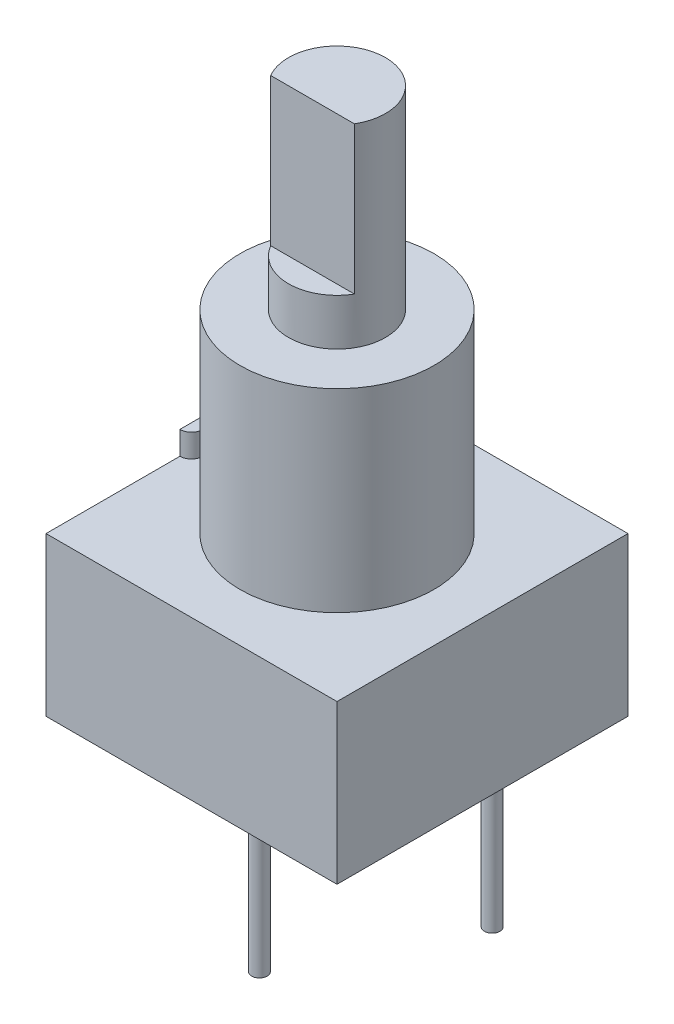
ISO-10303-21;
HEADER;
FILE_DESCRIPTION(('STEP AP214'),'2;1');
FILE_NAME('part.step','',(''),(''),'','','');
FILE_SCHEMA(('AUTOMOTIVE_DESIGN { 1 0 10303 214 1 1 1 1 }'));
ENDSEC;
DATA;
#1=APPLICATION_CONTEXT('core data for automotive mechanical design processes');
#2=APPLICATION_PROTOCOL_DEFINITION('international standard','automotive_design',2000,#1);
#3=PRODUCT_CONTEXT('',#1,'mechanical');
#4=PRODUCT('Part','Part','',(#3));
#5=PRODUCT_RELATED_PRODUCT_CATEGORY('part','',(#4));
#6=PRODUCT_DEFINITION_FORMATION('','',#4);
#7=PRODUCT_DEFINITION_CONTEXT('part definition',#1,'design');
#8=PRODUCT_DEFINITION('design','',#6,#7);
#9=PRODUCT_DEFINITION_SHAPE('','',#8);
#10=(LENGTH_UNIT() NAMED_UNIT(*) SI_UNIT(.MILLI.,.METRE.));
#11=(NAMED_UNIT(*) PLANE_ANGLE_UNIT() SI_UNIT($,.RADIAN.));
#12=(NAMED_UNIT(*) SI_UNIT($,.STERADIAN.) SOLID_ANGLE_UNIT());
#13=UNCERTAINTY_MEASURE_WITH_UNIT(LENGTH_MEASURE(1.E-05),#10,'distance_accuracy_value','');
#14=(GEOMETRIC_REPRESENTATION_CONTEXT(3) GLOBAL_UNCERTAINTY_ASSIGNED_CONTEXT((#13)) GLOBAL_UNIT_ASSIGNED_CONTEXT((#10,
#11,#12)) REPRESENTATION_CONTEXT('',''));
#15=CARTESIAN_POINT('',(0.,0.,0.));
#16=DIRECTION('',(0.,0.,1.));
#17=DIRECTION('',(1.,0.,0.));
#18=AXIS2_PLACEMENT_3D('',#15,#16,#17);
#19=CARTESIAN_POINT('',(0.,0.,0.));
#20=DIRECTION('',(0.,1.00000000000001,0.));
#21=DIRECTION('',(0.,0.,1.));
#22=AXIS2_PLACEMENT_3D('',#19,#20,#21);
#23=PLANE('',#22);
#24=CARTESIAN_POINT('',(0.,0.,0.));
#25=DIRECTION('',(0.,1.00000000000001,0.));
#26=DIRECTION('',(0.,0.,1.));
#27=AXIS2_PLACEMENT_3D('',#24,#25,#26);
#28=CIRCLE('',#27,3.175);
#29=CARTESIAN_POINT('',(0.,0.,3.175));
#30=VERTEX_POINT('',#29);
#31=EDGE_CURVE('E155',#30,#30,#28,.T.);
#32=ORIENTED_EDGE('',*,*,#31,.F.);
#33=EDGE_LOOP('',(#32));
#34=FACE_BOUND('',#33,.T.);
#35=DIRECTION('',(0.,0.,1.));
#36=VECTOR('',#35,1.);
#37=CARTESIAN_POINT('',(-4.7625,0.,4.76250000000001));
#38=LINE('',#37,#36);
#39=CARTESIAN_POINT('',(-4.7625,0.,-4.76249999999996));
#40=VERTEX_POINT('',#39);
#41=CARTESIAN_POINT('',(-4.7625,0.,-0.380999999999958));
#42=VERTEX_POINT('',#41);
#43=EDGE_CURVE('E74',#40,#42,#38,.T.);
#44=ORIENTED_EDGE('',*,*,#43,.T.);
#45=CARTESIAN_POINT('',(-4.7625,0.,0.));
#46=DIRECTION('',(0.,1.00000000000001,0.));
#47=DIRECTION('',(0.,0.,1.));
#48=AXIS2_PLACEMENT_3D('',#45,#46,#47);
#49=CIRCLE('',#48,0.381000000000001);
#50=CARTESIAN_POINT('',(-4.7625,0.,0.381000000000041));
#51=VERTEX_POINT('',#50);
#52=EDGE_CURVE('E142',#51,#42,#49,.T.);
#53=ORIENTED_EDGE('',*,*,#52,.F.);
#54=CARTESIAN_POINT('',(-4.7625,0.,4.76250000000001));
#55=VERTEX_POINT('',#54);
#56=EDGE_CURVE('E159',#51,#55,#38,.T.);
#57=ORIENTED_EDGE('',*,*,#56,.T.);
#58=DIRECTION('',(1.,0.,0.));
#59=VECTOR('',#58,1.);
#60=CARTESIAN_POINT('',(4.7625,1.12141997544655E-13,4.76250000000001));
#61=LINE('',#60,#59);
#62=CARTESIAN_POINT('',(4.7625,1.12141997544655E-13,4.76250000000001));
#63=VERTEX_POINT('',#62);
#64=EDGE_CURVE('E177',#55,#63,#61,.T.);
#65=ORIENTED_EDGE('',*,*,#64,.T.);
#66=DIRECTION('',(0.,0.,-1.));
#67=VECTOR('',#66,1.);
#68=CARTESIAN_POINT('',(4.7625,1.12141997544655E-13,4.76250000000001));
#69=LINE('',#68,#67);
#70=CARTESIAN_POINT('',(4.7625,1.11613253829178E-13,-4.76249999999998));
#71=VERTEX_POINT('',#70);
#72=EDGE_CURVE('E180',#63,#71,#69,.T.);
#73=ORIENTED_EDGE('',*,*,#72,.T.);
#74=DIRECTION('',(-1.,0.,0.));
#75=VECTOR('',#74,1.);
#76=CARTESIAN_POINT('',(4.7625,1.11613253829178E-13,-4.76249999999998));
#77=LINE('',#76,#75);
#78=EDGE_CURVE('E166',#71,#40,#77,.T.);
#79=ORIENTED_EDGE('',*,*,#78,.T.);
#80=EDGE_LOOP('',(#44,#53,#57,#65,#73,#79));
#81=FACE_BOUND('',#80,.T.);
#82=ADVANCED_FACE('F51',(#34,#81),#23,.T.);
#83=CARTESIAN_POINT('',(-4.7625,-5.18160000000001,4.76250000000001));
#84=DIRECTION('',(-1.,0.,0.));
#85=DIRECTION('',(0.,0.,1.));
#86=AXIS2_PLACEMENT_3D('',#83,#84,#85);
#87=PLANE('',#86);
#88=ORIENTED_EDGE('',*,*,#43,.F.);
#89=DIRECTION('',(0.,1.00000000000001,0.));
#90=VECTOR('',#89,1.);
#91=CARTESIAN_POINT('',(-4.7625,-5.18160000000001,-4.76249999999999));
#92=LINE('',#91,#90);
#93=CARTESIAN_POINT('',(-4.7625,-5.18160000000001,-4.76249999999999));
#94=VERTEX_POINT('',#93);
#95=EDGE_CURVE('E184',#94,#40,#92,.T.);
#96=ORIENTED_EDGE('',*,*,#95,.F.);
#97=DIRECTION('',(0.,0.,1.));
#98=VECTOR('',#97,1.);
#99=CARTESIAN_POINT('',(-4.7625,-5.18160000000001,4.76250000000001));
#100=LINE('',#99,#98);
#101=CARTESIAN_POINT('',(-4.7625,-5.18160000000001,4.76250000000001));
#102=VERTEX_POINT('',#101);
#103=EDGE_CURVE('E162',#94,#102,#100,.T.);
#104=ORIENTED_EDGE('',*,*,#103,.T.);
#105=DIRECTION('',(0.,1.00000000000001,0.));
#106=VECTOR('',#105,1.);
#107=CARTESIAN_POINT('',(-4.7625,-5.18160000000001,4.76250000000001));
#108=LINE('',#107,#106);
#109=EDGE_CURVE('E175',#102,#55,#108,.T.);
#110=ORIENTED_EDGE('',*,*,#109,.T.);
#111=ORIENTED_EDGE('',*,*,#56,.F.);
#112=DIRECTION('',(0.,-1.00000000000001,0.));
#113=VECTOR('',#112,1.);
#114=CARTESIAN_POINT('',(-4.7625,0.762000000000013,0.381000000000041));
#115=LINE('',#114,#113);
#116=CARTESIAN_POINT('',(-4.7625,0.762000000000013,0.381000000000041));
#117=VERTEX_POINT('',#116);
#118=EDGE_CURVE('E148',#117,#51,#115,.T.);
#119=ORIENTED_EDGE('',*,*,#118,.F.);
#120=DIRECTION('',(0.,0.,1.));
#121=VECTOR('',#120,1.);
#122=CARTESIAN_POINT('',(-4.7625,0.762000000000013,-0.380999999999958));
#123=LINE('',#122,#121);
#124=CARTESIAN_POINT('',(-4.7625,0.762000000000013,-0.380999999999958));
#125=VERTEX_POINT('',#124);
#126=EDGE_CURVE('E146',#125,#117,#123,.T.);
#127=ORIENTED_EDGE('',*,*,#126,.F.);
#128=DIRECTION('',(0.,-1.00000000000001,0.));
#129=VECTOR('',#128,1.);
#130=CARTESIAN_POINT('',(-4.7625,0.762000000000013,-0.380999999999958));
#131=LINE('',#130,#129);
#132=EDGE_CURVE('E153',#125,#42,#131,.T.);
#133=ORIENTED_EDGE('',*,*,#132,.T.);
#134=EDGE_LOOP('',(#88,#96,#104,#110,#111,#119,#127,#133));
#135=FACE_BOUND('',#134,.T.);
#136=ADVANCED_FACE('F53',(#135),#87,.T.);
#137=CARTESIAN_POINT('',(4.7625,-5.1815999999999,-4.76250000000003));
#138=DIRECTION('',(0.,0.,-1.));
#139=DIRECTION('',(-1.,0.,0.));
#140=AXIS2_PLACEMENT_3D('',#137,#138,#139);
#141=PLANE('',#140);
#142=ORIENTED_EDGE('',*,*,#78,.F.);
#143=DIRECTION('',(0.,1.00000000000001,0.));
#144=VECTOR('',#143,1.);
#145=CARTESIAN_POINT('',(4.7625,-5.1815999999999,-4.76250000000003));
#146=LINE('',#145,#144);
#147=CARTESIAN_POINT('',(4.7625,-5.1815999999999,-4.76250000000003));
#148=VERTEX_POINT('',#147);
#149=EDGE_CURVE('E187',#148,#71,#146,.T.);
#150=ORIENTED_EDGE('',*,*,#149,.F.);
#151=DIRECTION('',(-1.,0.,0.));
#152=VECTOR('',#151,1.);
#153=CARTESIAN_POINT('',(4.7625,-5.1815999999999,-4.76250000000003));
#154=LINE('',#153,#152);
#155=EDGE_CURVE('E172',#148,#94,#154,.T.);
#156=ORIENTED_EDGE('',*,*,#155,.T.);
#157=ORIENTED_EDGE('',*,*,#95,.T.);
#158=EDGE_LOOP('',(#142,#150,#156,#157));
#159=FACE_BOUND('',#158,.T.);
#160=ADVANCED_FACE('F215',(#159),#141,.T.);
#161=CARTESIAN_POINT('',(4.7625,-5.1815999999999,4.76250000000001));
#162=DIRECTION('',(1.,0.,0.));
#163=DIRECTION('',(0.,0.,-1.));
#164=AXIS2_PLACEMENT_3D('',#161,#162,#163);
#165=PLANE('',#164);
#166=ORIENTED_EDGE('',*,*,#72,.F.);
#167=DIRECTION('',(0.,1.00000000000001,0.));
#168=VECTOR('',#167,1.);
#169=CARTESIAN_POINT('',(4.7625,-5.1815999999999,4.76250000000001));
#170=LINE('',#169,#168);
#171=CARTESIAN_POINT('',(4.7625,-5.1815999999999,4.76250000000001));
#172=VERTEX_POINT('',#171);
#173=EDGE_CURVE('E189',#172,#63,#170,.T.);
#174=ORIENTED_EDGE('',*,*,#173,.F.);
#175=DIRECTION('',(0.,0.,-1.));
#176=VECTOR('',#175,1.);
#177=CARTESIAN_POINT('',(4.7625,-5.1815999999999,4.76250000000001));
#178=LINE('',#177,#176);
#179=EDGE_CURVE('E169',#172,#148,#178,.T.);
#180=ORIENTED_EDGE('',*,*,#179,.T.);
#181=ORIENTED_EDGE('',*,*,#149,.T.);
#182=EDGE_LOOP('',(#166,#174,#180,#181));
#183=FACE_BOUND('',#182,.T.);
#184=ADVANCED_FACE('F218',(#183),#165,.T.);
#185=CARTESIAN_POINT('',(4.7625,-5.1815999999999,4.76250000000001));
#186=DIRECTION('',(0.,0.,1.));
#187=DIRECTION('',(1.,0.,0.));
#188=AXIS2_PLACEMENT_3D('',#185,#186,#187);
#189=PLANE('',#188);
#190=ORIENTED_EDGE('',*,*,#64,.F.);
#191=ORIENTED_EDGE('',*,*,#109,.F.);
#192=DIRECTION('',(1.,0.,0.));
#193=VECTOR('',#192,1.);
#194=CARTESIAN_POINT('',(4.7625,-5.1815999999999,4.76250000000001));
#195=LINE('',#194,#193);
#196=EDGE_CURVE('E165',#102,#172,#195,.T.);
#197=ORIENTED_EDGE('',*,*,#196,.T.);
#198=ORIENTED_EDGE('',*,*,#173,.T.);
#199=EDGE_LOOP('',(#190,#191,#197,#198));
#200=FACE_BOUND('',#199,.T.);
#201=ADVANCED_FACE('F203',(#200),#189,.T.);
#202=CARTESIAN_POINT('',(0.,-5.18160000000001,0.));
#203=DIRECTION('',(0.,1.00000000000001,0.));
#204=DIRECTION('',(0.,0.,1.));
#205=AXIS2_PLACEMENT_3D('',#202,#203,#204);
#206=PLANE('',#205);
#207=CARTESIAN_POINT('',(2.54,-5.18160000000001,-2.54000000000003));
#208=DIRECTION('',(0.,1.00000000000001,0.));
#209=DIRECTION('',(0.,0.,1.));
#210=AXIS2_PLACEMENT_3D('',#207,#208,#209);
#211=CIRCLE('',#210,0.254000000000001);
#212=CARTESIAN_POINT('',(2.54,-5.18160000000001,-2.28600000000003));
#213=VERTEX_POINT('',#212);
#214=EDGE_CURVE('E14',#213,#213,#211,.F.);
#215=ORIENTED_EDGE('',*,*,#214,.F.);
#216=EDGE_LOOP('',(#215));
#217=FACE_BOUND('',#216,.T.);
#218=CARTESIAN_POINT('',(-2.54,-5.18160000000001,-2.53999999999999));
#219=DIRECTION('',(0.,1.00000000000001,0.));
#220=DIRECTION('',(0.,0.,1.));
#221=AXIS2_PLACEMENT_3D('',#218,#219,#220);
#222=CIRCLE('',#221,0.254);
#223=CARTESIAN_POINT('',(-2.54,-5.18160000000001,-2.28599999999999));
#224=VERTEX_POINT('',#223);
#225=EDGE_CURVE('E59',#224,#224,#222,.F.);
#226=ORIENTED_EDGE('',*,*,#225,.F.);
#227=EDGE_LOOP('',(#226));
#228=FACE_BOUND('',#227,.T.);
#229=CARTESIAN_POINT('',(0.,-5.18160000000001,2.54000000000001));
#230=DIRECTION('',(0.,1.00000000000001,0.));
#231=DIRECTION('',(0.,0.,1.));
#232=AXIS2_PLACEMENT_3D('',#229,#230,#231);
#233=CIRCLE('',#232,0.254);
#234=CARTESIAN_POINT('',(0.,-5.18160000000001,2.79400000000001));
#235=VERTEX_POINT('',#234);
#236=EDGE_CURVE('E186',#235,#235,#233,.F.);
#237=ORIENTED_EDGE('',*,*,#236,.F.);
#238=EDGE_LOOP('',(#237));
#239=FACE_BOUND('',#238,.T.);
#240=ORIENTED_EDGE('',*,*,#103,.F.);
#241=ORIENTED_EDGE('',*,*,#155,.F.);
#242=ORIENTED_EDGE('',*,*,#179,.F.);
#243=ORIENTED_EDGE('',*,*,#196,.F.);
#244=EDGE_LOOP('',(#240,#241,#242,#243));
#245=FACE_BOUND('',#244,.T.);
#246=ADVANCED_FACE('F199',(#217,#228,#239,#245),#206,.F.);
#247=CARTESIAN_POINT('',(0.,6.35,0.));
#248=DIRECTION('',(0.,-1.00000000000001,0.));
#249=DIRECTION('',(0.,0.,-1.));
#250=AXIS2_PLACEMENT_3D('',#247,#248,#249);
#251=CYLINDRICAL_SURFACE('',#250,3.175);
#252=CARTESIAN_POINT('',(0.,6.35,0.));
#253=DIRECTION('',(0.,1.00000000000001,0.));
#254=DIRECTION('',(0.,0.,1.));
#255=AXIS2_PLACEMENT_3D('',#252,#253,#254);
#256=CIRCLE('',#255,3.175);
#257=CARTESIAN_POINT('',(0.,6.35,3.175));
#258=VERTEX_POINT('',#257);
#259=EDGE_CURVE('E156',#258,#258,#256,.T.);
#260=ORIENTED_EDGE('',*,*,#259,.F.);
#261=EDGE_LOOP('',(#260));
#262=FACE_BOUND('',#261,.T.);
#263=ORIENTED_EDGE('',*,*,#31,.T.);
#264=EDGE_LOOP('',(#263));
#265=FACE_BOUND('',#264,.T.);
#266=ADVANCED_FACE('F202',(#262,#265),#251,.T.);
#267=CARTESIAN_POINT('',(0.,6.35,0.));
#268=DIRECTION('',(0.,1.00000000000001,0.));
#269=DIRECTION('',(0.,0.,1.));
#270=AXIS2_PLACEMENT_3D('',#267,#268,#269);
#271=PLANE('',#270);
#272=CARTESIAN_POINT('',(0.,6.35,0.));
#273=DIRECTION('',(0.,1.00000000000001,0.));
#274=DIRECTION('',(0.,0.,1.));
#275=AXIS2_PLACEMENT_3D('',#272,#273,#274);
#276=CIRCLE('',#275,1.5875);
#277=CARTESIAN_POINT('',(0.,6.35,1.5875));
#278=VERTEX_POINT('',#277);
#279=EDGE_CURVE('E135',#278,#278,#276,.T.);
#280=ORIENTED_EDGE('',*,*,#279,.F.);
#281=EDGE_LOOP('',(#280));
#282=FACE_BOUND('',#281,.T.);
#283=ORIENTED_EDGE('',*,*,#259,.T.);
#284=EDGE_LOOP('',(#283));
#285=FACE_BOUND('',#284,.T.);
#286=ADVANCED_FACE('F236',(#282,#285),#271,.T.);
#287=CARTESIAN_POINT('',(-4.7625,0.762000000000013,0.));
#288=DIRECTION('',(0.,-1.00000000000001,0.));
#289=DIRECTION('',(0.,0.,-1.));
#290=AXIS2_PLACEMENT_3D('',#287,#288,#289);
#291=CYLINDRICAL_SURFACE('',#290,0.381000000000001);
#292=ORIENTED_EDGE('',*,*,#52,.T.);
#293=ORIENTED_EDGE('',*,*,#132,.F.);
#294=CARTESIAN_POINT('',(-4.7625,0.762000000000013,0.));
#295=DIRECTION('',(0.,1.00000000000001,0.));
#296=DIRECTION('',(0.,0.,1.));
#297=AXIS2_PLACEMENT_3D('',#294,#295,#296);
#298=CIRCLE('',#297,0.381000000000001);
#299=EDGE_CURVE('E143',#117,#125,#298,.T.);
#300=ORIENTED_EDGE('',*,*,#299,.F.);
#301=ORIENTED_EDGE('',*,*,#118,.T.);
#302=EDGE_LOOP('',(#292,#293,#300,#301));
#303=FACE_BOUND('',#302,.T.);
#304=ADVANCED_FACE('F225',(#303),#291,.T.);
#305=CARTESIAN_POINT('',(-4.7625,0.762000000000013,0.));
#306=DIRECTION('',(0.,1.00000000000001,0.));
#307=DIRECTION('',(0.,0.,1.));
#308=AXIS2_PLACEMENT_3D('',#305,#306,#307);
#309=PLANE('',#308);
#310=ORIENTED_EDGE('',*,*,#299,.T.);
#311=ORIENTED_EDGE('',*,*,#126,.T.);
#312=EDGE_LOOP('',(#310,#311));
#313=FACE_BOUND('',#312,.T.);
#314=ADVANCED_FACE('F227',(#313),#309,.T.);
#315=CARTESIAN_POINT('',(0.,29.8901280605347,0.));
#316=DIRECTION('',(0.,-1.00000000000001,0.));
#317=DIRECTION('',(0.,0.,-1.));
#318=AXIS2_PLACEMENT_3D('',#315,#316,#317);
#319=CYLINDRICAL_SURFACE('',#318,1.5875);
#320=CARTESIAN_POINT('',(0.,12.7000000000001,0.));
#321=DIRECTION('',(0.,1.00000000000001,0.));
#322=DIRECTION('',(0.,0.,1.));
#323=AXIS2_PLACEMENT_3D('',#320,#321,#322);
#324=CIRCLE('',#323,1.5875);
#325=CARTESIAN_POINT('',(1.37112954894858,12.7000000000001,0.800099999999998));
#326=VERTEX_POINT('',#325);
#327=CARTESIAN_POINT('',(-1.37112954894863,12.7000000000001,0.800099999999998));
#328=VERTEX_POINT('',#327);
#329=EDGE_CURVE('E133',#326,#328,#324,.T.);
#330=ORIENTED_EDGE('',*,*,#329,.F.);
#331=DIRECTION('',(0.,1.00000000000001,0.));
#332=VECTOR('',#331,1.);
#333=CARTESIAN_POINT('',(1.37112954894857,7.874,0.800099999999998));
#334=LINE('',#333,#332);
#335=CARTESIAN_POINT('',(1.37112954894857,7.874,0.800099999999998));
#336=VERTEX_POINT('',#335);
#337=EDGE_CURVE('E66',#336,#326,#334,.T.);
#338=ORIENTED_EDGE('',*,*,#337,.F.);
#339=CARTESIAN_POINT('',(0.,7.874,0.));
#340=DIRECTION('',(0.,1.00000000000001,0.));
#341=DIRECTION('',(0.,0.,1.));
#342=AXIS2_PLACEMENT_3D('',#339,#340,#341);
#343=CIRCLE('',#342,1.5875);
#344=CARTESIAN_POINT('',(-1.37112954894863,7.874,0.800099999999998));
#345=VERTEX_POINT('',#344);
#346=EDGE_CURVE('E119',#345,#336,#343,.T.);
#347=ORIENTED_EDGE('',*,*,#346,.F.);
#348=DIRECTION('',(0.,1.00000000000001,0.));
#349=VECTOR('',#348,1.);
#350=CARTESIAN_POINT('',(-1.37112954894863,7.874,0.800099999999998));
#351=LINE('',#350,#349);
#352=EDGE_CURVE('E127',#345,#328,#351,.T.);
#353=ORIENTED_EDGE('',*,*,#352,.T.);
#354=EDGE_LOOP('',(#330,#338,#347,#353));
#355=FACE_BOUND('',#354,.T.);
#356=ORIENTED_EDGE('',*,*,#279,.T.);
#357=EDGE_LOOP('',(#356));
#358=FACE_BOUND('',#357,.T.);
#359=ADVANCED_FACE('F130',(#355,#358),#319,.T.);
#360=CARTESIAN_POINT('',(0.,12.7000000000001,0.));
#361=DIRECTION('',(0.,1.00000000000001,0.));
#362=DIRECTION('',(0.,0.,1.));
#363=AXIS2_PLACEMENT_3D('',#360,#361,#362);
#364=PLANE('',#363);
#365=DIRECTION('',(-1.,0.,0.));
#366=VECTOR('',#365,1.);
#367=CARTESIAN_POINT('',(-1.37112954894863,12.7000000000001,0.800099999999998));
#368=LINE('',#367,#366);
#369=EDGE_CURVE('E124',#326,#328,#368,.T.);
#370=ORIENTED_EDGE('',*,*,#369,.F.);
#371=ORIENTED_EDGE('',*,*,#329,.T.);
#372=EDGE_LOOP('',(#370,#371));
#373=FACE_BOUND('',#372,.T.);
#374=ADVANCED_FACE('F234',(#373),#364,.T.);
#375=CARTESIAN_POINT('',(-1.37112954894863,7.874,0.800099999999998));
#376=DIRECTION('',(0.,0.,-1.));
#377=DIRECTION('',(-1.,0.,0.));
#378=AXIS2_PLACEMENT_3D('',#375,#376,#377);
#379=PLANE('',#378);
#380=ORIENTED_EDGE('',*,*,#369,.T.);
#381=ORIENTED_EDGE('',*,*,#352,.F.);
#382=DIRECTION('',(-1.,0.,0.));
#383=VECTOR('',#382,1.);
#384=CARTESIAN_POINT('',(-1.37112954894863,7.874,0.800099999999998));
#385=LINE('',#384,#383);
#386=EDGE_CURVE('E121',#336,#345,#385,.T.);
#387=ORIENTED_EDGE('',*,*,#386,.F.);
#388=ORIENTED_EDGE('',*,*,#337,.T.);
#389=EDGE_LOOP('',(#380,#381,#387,#388));
#390=FACE_BOUND('',#389,.T.);
#391=ADVANCED_FACE('F126',(#390),#379,.F.);
#392=CARTESIAN_POINT('',(0.,7.874,0.));
#393=DIRECTION('',(0.,1.00000000000001,0.));
#394=DIRECTION('',(0.,0.,1.));
#395=AXIS2_PLACEMENT_3D('',#392,#393,#394);
#396=PLANE('',#395);
#397=ORIENTED_EDGE('',*,*,#346,.T.);
#398=ORIENTED_EDGE('',*,*,#386,.T.);
#399=EDGE_LOOP('',(#397,#398));
#400=FACE_BOUND('',#399,.T.);
#401=ADVANCED_FACE('F120',(#400),#396,.T.);
#402=CARTESIAN_POINT('',(0.,-11.1506,2.54000000000001));
#403=DIRECTION('',(0.,1.00000000000001,0.));
#404=DIRECTION('',(0.,0.,1.));
#405=AXIS2_PLACEMENT_3D('',#402,#403,#404);
#406=CYLINDRICAL_SURFACE('',#405,0.254);
#407=CARTESIAN_POINT('',(0.,-11.1506,2.54000000000001));
#408=DIRECTION('',(0.,-1.00000000000001,0.));
#409=DIRECTION('',(0.,0.,-1.));
#410=AXIS2_PLACEMENT_3D('',#407,#408,#409);
#411=CIRCLE('',#410,0.254);
#412=CARTESIAN_POINT('',(0.,-11.1506,2.28600000000001));
#413=VERTEX_POINT('',#412);
#414=EDGE_CURVE('E360',#413,#413,#411,.T.);
#415=ORIENTED_EDGE('',*,*,#414,.F.);
#416=EDGE_LOOP('',(#415));
#417=FACE_BOUND('',#416,.T.);
#418=ORIENTED_EDGE('',*,*,#236,.T.);
#419=EDGE_LOOP('',(#418));
#420=FACE_BOUND('',#419,.T.);
#421=ADVANCED_FACE('F306',(#417,#420),#406,.T.);
#422=CARTESIAN_POINT('',(0.,-11.1506,2.54000000000001));
#423=DIRECTION('',(0.,-1.00000000000001,0.));
#424=DIRECTION('',(0.,0.,-1.));
#425=AXIS2_PLACEMENT_3D('',#422,#423,#424);
#426=PLANE('',#425);
#427=ORIENTED_EDGE('',*,*,#414,.T.);
#428=EDGE_LOOP('',(#427));
#429=FACE_BOUND('',#428,.T.);
#430=ADVANCED_FACE('F313',(#429),#426,.T.);
#431=CARTESIAN_POINT('',(-2.54,-11.1506,-2.53999999999999));
#432=DIRECTION('',(0.,1.00000000000001,0.));
#433=DIRECTION('',(0.,0.,1.));
#434=AXIS2_PLACEMENT_3D('',#431,#432,#433);
#435=CYLINDRICAL_SURFACE('',#434,0.254);
#436=CARTESIAN_POINT('',(-2.54,-11.1506,-2.53999999999999));
#437=DIRECTION('',(0.,-1.00000000000001,0.));
#438=DIRECTION('',(0.,0.,-1.));
#439=AXIS2_PLACEMENT_3D('',#436,#437,#438);
#440=CIRCLE('',#439,0.254);
#441=CARTESIAN_POINT('',(-2.54,-11.1506,-2.79399999999999));
#442=VERTEX_POINT('',#441);
#443=EDGE_CURVE('E357',#442,#442,#440,.T.);
#444=ORIENTED_EDGE('',*,*,#443,.F.);
#445=EDGE_LOOP('',(#444));
#446=FACE_BOUND('',#445,.T.);
#447=ORIENTED_EDGE('',*,*,#225,.T.);
#448=EDGE_LOOP('',(#447));
#449=FACE_BOUND('',#448,.T.);
#450=ADVANCED_FACE('F197',(#446,#449),#435,.T.);
#451=CARTESIAN_POINT('',(-2.54,-11.1506,-2.53999999999999));
#452=DIRECTION('',(0.,-1.00000000000001,0.));
#453=DIRECTION('',(0.,0.,-1.));
#454=AXIS2_PLACEMENT_3D('',#451,#452,#453);
#455=PLANE('',#454);
#456=ORIENTED_EDGE('',*,*,#443,.T.);
#457=EDGE_LOOP('',(#456));
#458=FACE_BOUND('',#457,.T.);
#459=ADVANCED_FACE('F328',(#458),#455,.T.);
#460=CARTESIAN_POINT('',(2.54,-11.1506,-2.54000000000003));
#461=DIRECTION('',(0.,1.00000000000001,0.));
#462=DIRECTION('',(0.,0.,1.));
#463=AXIS2_PLACEMENT_3D('',#460,#461,#462);
#464=CYLINDRICAL_SURFACE('',#463,0.254000000000001);
#465=CARTESIAN_POINT('',(2.54,-11.1506,-2.54000000000003));
#466=DIRECTION('',(0.,-1.00000000000001,0.));
#467=DIRECTION('',(0.,0.,-1.));
#468=AXIS2_PLACEMENT_3D('',#465,#466,#467);
#469=CIRCLE('',#468,0.254000000000001);
#470=CARTESIAN_POINT('',(2.54,-11.1506,-2.79400000000003));
#471=VERTEX_POINT('',#470);
#472=EDGE_CURVE('E356',#471,#471,#469,.T.);
#473=ORIENTED_EDGE('',*,*,#472,.F.);
#474=EDGE_LOOP('',(#473));
#475=FACE_BOUND('',#474,.T.);
#476=ORIENTED_EDGE('',*,*,#214,.T.);
#477=EDGE_LOOP('',(#476));
#478=FACE_BOUND('',#477,.T.);
#479=ADVANCED_FACE('F336',(#475,#478),#464,.T.);
#480=CARTESIAN_POINT('',(2.54,-11.1506,-2.54000000000003));
#481=DIRECTION('',(0.,-1.00000000000001,0.));
#482=DIRECTION('',(0.,0.,-1.));
#483=AXIS2_PLACEMENT_3D('',#480,#481,#482);
#484=PLANE('',#483);
#485=ORIENTED_EDGE('',*,*,#472,.T.);
#486=EDGE_LOOP('',(#485));
#487=FACE_BOUND('',#486,.T.);
#488=ADVANCED_FACE('F344',(#487),#484,.T.);
#489=CLOSED_SHELL('',(#82,#136,#160,#184,#201,#246,#266,#286,#304,#314,#359,#374,#391,#401,#421,
#430,#450,#459,#479,#488));
#490=MANIFOLD_SOLID_BREP('B2',#489);
#491=ADVANCED_BREP_SHAPE_REPRESENTATION('',(#18,#490),#14);
#492=SHAPE_DEFINITION_REPRESENTATION(#9,#491);
ENDSEC;
END-ISO-10303-21;
